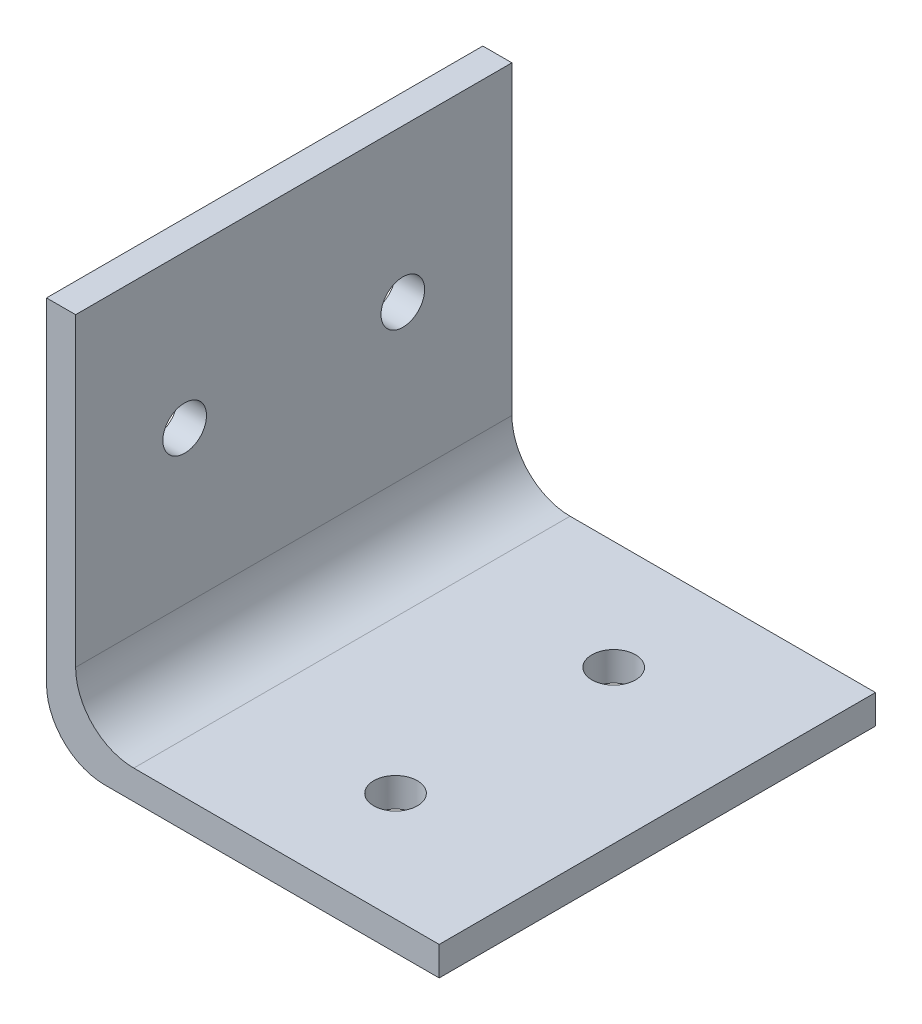
ISO-10303-21;
HEADER;
FILE_DESCRIPTION(('STEP AP214'),'2;1');
FILE_NAME('part.step','',(''),(''),'','','');
FILE_SCHEMA(('AUTOMOTIVE_DESIGN { 1 0 10303 214 1 1 1 1 }'));
ENDSEC;
DATA;
#1=APPLICATION_CONTEXT('core data for automotive mechanical design processes');
#2=APPLICATION_PROTOCOL_DEFINITION('international standard','automotive_design',2000,#1);
#3=PRODUCT_CONTEXT('',#1,'mechanical');
#4=PRODUCT('Part','Part','',(#3));
#5=PRODUCT_RELATED_PRODUCT_CATEGORY('part','',(#4));
#6=PRODUCT_DEFINITION_FORMATION('','',#4);
#7=PRODUCT_DEFINITION_CONTEXT('part definition',#1,'design');
#8=PRODUCT_DEFINITION('design','',#6,#7);
#9=PRODUCT_DEFINITION_SHAPE('','',#8);
#10=(LENGTH_UNIT() NAMED_UNIT(*) SI_UNIT(.MILLI.,.METRE.));
#11=(NAMED_UNIT(*) PLANE_ANGLE_UNIT() SI_UNIT($,.RADIAN.));
#12=(NAMED_UNIT(*) SI_UNIT($,.STERADIAN.) SOLID_ANGLE_UNIT());
#13=UNCERTAINTY_MEASURE_WITH_UNIT(LENGTH_MEASURE(1.E-05),#10,'distance_accuracy_value','');
#14=(GEOMETRIC_REPRESENTATION_CONTEXT(3) GLOBAL_UNCERTAINTY_ASSIGNED_CONTEXT((#13)) GLOBAL_UNIT_ASSIGNED_CONTEXT((#10,
#11,#12)) REPRESENTATION_CONTEXT('',''));
#15=CARTESIAN_POINT('',(0.,0.,0.));
#16=DIRECTION('',(0.,0.,1.));
#17=DIRECTION('',(1.,0.,0.));
#18=AXIS2_PLACEMENT_3D('',#15,#16,#17);
#19=CARTESIAN_POINT('',(0.,25.,-30.));
#20=DIRECTION('',(1.,0.,0.));
#21=DIRECTION('',(0.,1.,0.));
#22=AXIS2_PLACEMENT_3D('',#19,#20,#21);
#23=PLANE('',#22);
#24=CARTESIAN_POINT('',(0.,14.5,-7.5));
#25=DIRECTION('',(1.,0.,0.));
#26=DIRECTION('',(0.,0.,-1.));
#27=AXIS2_PLACEMENT_3D('',#24,#25,#26);
#28=CIRCLE('',#27,1.49999999999999);
#29=CARTESIAN_POINT('',(0.,14.5,-8.99999999999999));
#30=VERTEX_POINT('',#29);
#31=EDGE_CURVE('E232',#30,#30,#28,.T.);
#32=ORIENTED_EDGE('',*,*,#31,.F.);
#33=EDGE_LOOP('',(#32));
#34=FACE_BOUND('',#33,.T.);
#35=CARTESIAN_POINT('',(0.,14.5,-22.5));
#36=DIRECTION('',(1.,0.,0.));
#37=DIRECTION('',(0.,0.,-1.));
#38=AXIS2_PLACEMENT_3D('',#35,#36,#37);
#39=CIRCLE('',#38,1.49999999999999);
#40=CARTESIAN_POINT('',(0.,14.5,-24.));
#41=VERTEX_POINT('',#40);
#42=EDGE_CURVE('E236',#41,#41,#39,.T.);
#43=ORIENTED_EDGE('',*,*,#42,.F.);
#44=EDGE_LOOP('',(#43));
#45=FACE_BOUND('',#44,.T.);
#46=DIRECTION('',(0.,1.,0.));
#47=VECTOR('',#46,1.);
#48=CARTESIAN_POINT('',(0.,25.,0.));
#49=LINE('',#48,#47);
#50=CARTESIAN_POINT('',(0.,4.,0.));
#51=VERTEX_POINT('',#50);
#52=CARTESIAN_POINT('',(0.,25.,0.));
#53=VERTEX_POINT('',#52);
#54=EDGE_CURVE('E134',#51,#53,#49,.T.);
#55=ORIENTED_EDGE('',*,*,#54,.F.);
#56=DIRECTION('',(0.,0.,1.));
#57=VECTOR('',#56,1.);
#58=CARTESIAN_POINT('',(0.,4.,-30.));
#59=LINE('',#58,#57);
#60=CARTESIAN_POINT('',(0.,4.,-30.));
#61=VERTEX_POINT('',#60);
#62=EDGE_CURVE('E104',#51,#61,#59,.F.);
#63=ORIENTED_EDGE('',*,*,#62,.T.);
#64=DIRECTION('',(0.,1.,0.));
#65=VECTOR('',#64,1.);
#66=CARTESIAN_POINT('',(0.,25.,-30.));
#67=LINE('',#66,#65);
#68=CARTESIAN_POINT('',(0.,25.,-30.));
#69=VERTEX_POINT('',#68);
#70=EDGE_CURVE('E98',#61,#69,#67,.T.);
#71=ORIENTED_EDGE('',*,*,#70,.T.);
#72=DIRECTION('',(0.,0.,1.));
#73=VECTOR('',#72,1.);
#74=CARTESIAN_POINT('',(0.,25.,-30.));
#75=LINE('',#74,#73);
#76=EDGE_CURVE('E101',#69,#53,#75,.T.);
#77=ORIENTED_EDGE('',*,*,#76,.T.);
#78=EDGE_LOOP('',(#55,#63,#71,#77));
#79=FACE_BOUND('',#78,.T.);
#80=ADVANCED_FACE('F35',(#34,#45,#79),#23,.T.);
#81=CARTESIAN_POINT('',(0.,0.,-30.));
#82=DIRECTION('',(0.,1.,0.));
#83=DIRECTION('',(0.,0.,1.));
#84=AXIS2_PLACEMENT_3D('',#81,#82,#83);
#85=PLANE('',#84);
#86=CARTESIAN_POINT('',(14.5,0.,-22.5));
#87=DIRECTION('',(0.,1.,0.));
#88=DIRECTION('',(0.,0.,1.));
#89=AXIS2_PLACEMENT_3D('',#86,#87,#88);
#90=CIRCLE('',#89,1.49999999999999);
#91=CARTESIAN_POINT('',(14.5,0.,-21.));
#92=VERTEX_POINT('',#91);
#93=EDGE_CURVE('E245',#92,#92,#90,.T.);
#94=ORIENTED_EDGE('',*,*,#93,.F.);
#95=EDGE_LOOP('',(#94));
#96=FACE_BOUND('',#95,.T.);
#97=CARTESIAN_POINT('',(14.5,0.,-7.5));
#98=DIRECTION('',(0.,1.,0.));
#99=DIRECTION('',(0.,0.,1.));
#100=AXIS2_PLACEMENT_3D('',#97,#98,#99);
#101=CIRCLE('',#100,1.49999999999999);
#102=CARTESIAN_POINT('',(14.5,0.,-6.00000000000001));
#103=VERTEX_POINT('',#102);
#104=EDGE_CURVE('E251',#103,#103,#101,.T.);
#105=ORIENTED_EDGE('',*,*,#104,.F.);
#106=EDGE_LOOP('',(#105));
#107=FACE_BOUND('',#106,.T.);
#108=DIRECTION('',(-1.,0.,0.));
#109=VECTOR('',#108,1.);
#110=CARTESIAN_POINT('',(0.,0.,-30.));
#111=LINE('',#110,#109);
#112=CARTESIAN_POINT('',(25.,0.,-30.));
#113=VERTEX_POINT('',#112);
#114=CARTESIAN_POINT('',(4.,0.,-30.));
#115=VERTEX_POINT('',#114);
#116=EDGE_CURVE('E117',#113,#115,#111,.T.);
#117=ORIENTED_EDGE('',*,*,#116,.T.);
#118=DIRECTION('',(0.,0.,1.));
#119=VECTOR('',#118,1.);
#120=CARTESIAN_POINT('',(4.,0.,0.));
#121=LINE('',#120,#119);
#122=CARTESIAN_POINT('',(4.,0.,0.));
#123=VERTEX_POINT('',#122);
#124=EDGE_CURVE('E149',#115,#123,#121,.T.);
#125=ORIENTED_EDGE('',*,*,#124,.T.);
#126=DIRECTION('',(-1.,0.,0.));
#127=VECTOR('',#126,1.);
#128=CARTESIAN_POINT('',(0.,0.,0.));
#129=LINE('',#128,#127);
#130=CARTESIAN_POINT('',(25.,0.,0.));
#131=VERTEX_POINT('',#130);
#132=EDGE_CURVE('E109',#131,#123,#129,.T.);
#133=ORIENTED_EDGE('',*,*,#132,.F.);
#134=DIRECTION('',(0.,0.,1.));
#135=VECTOR('',#134,1.);
#136=CARTESIAN_POINT('',(25.,0.,-30.));
#137=LINE('',#136,#135);
#138=EDGE_CURVE('E147',#113,#131,#137,.T.);
#139=ORIENTED_EDGE('',*,*,#138,.F.);
#140=EDGE_LOOP('',(#117,#125,#133,#139));
#141=FACE_BOUND('',#140,.T.);
#142=ADVANCED_FACE('F177',(#96,#107,#141),#85,.T.);
#143=CARTESIAN_POINT('',(25.,0.,-30.));
#144=DIRECTION('',(1.,0.,0.));
#145=DIRECTION('',(0.,0.,-1.));
#146=AXIS2_PLACEMENT_3D('',#143,#144,#145);
#147=PLANE('',#146);
#148=DIRECTION('',(0.,1.,0.));
#149=VECTOR('',#148,1.);
#150=CARTESIAN_POINT('',(25.,0.,0.));
#151=LINE('',#150,#149);
#152=CARTESIAN_POINT('',(25.,-2.,0.));
#153=VERTEX_POINT('',#152);
#154=EDGE_CURVE('E142',#153,#131,#151,.T.);
#155=ORIENTED_EDGE('',*,*,#154,.F.);
#156=DIRECTION('',(0.,0.,1.));
#157=VECTOR('',#156,1.);
#158=CARTESIAN_POINT('',(25.,-2.,-30.));
#159=LINE('',#158,#157);
#160=CARTESIAN_POINT('',(25.,-2.,-30.));
#161=VERTEX_POINT('',#160);
#162=EDGE_CURVE('E150',#161,#153,#159,.T.);
#163=ORIENTED_EDGE('',*,*,#162,.F.);
#164=DIRECTION('',(0.,1.,0.));
#165=VECTOR('',#164,1.);
#166=CARTESIAN_POINT('',(25.,0.,-30.));
#167=LINE('',#166,#165);
#168=EDGE_CURVE('E129',#161,#113,#167,.T.);
#169=ORIENTED_EDGE('',*,*,#168,.T.);
#170=ORIENTED_EDGE('',*,*,#138,.T.);
#171=EDGE_LOOP('',(#155,#163,#169,#170));
#172=FACE_BOUND('',#171,.T.);
#173=ADVANCED_FACE('F182',(#172),#147,.T.);
#174=CARTESIAN_POINT('',(25.,-2.,-30.));
#175=DIRECTION('',(0.,-1.,0.));
#176=DIRECTION('',(1.,0.,0.));
#177=AXIS2_PLACEMENT_3D('',#174,#175,#176);
#178=PLANE('',#177);
#179=CARTESIAN_POINT('',(14.5,-2.,-22.5));
#180=DIRECTION('',(0.,-1.,0.));
#181=DIRECTION('',(1.,0.,0.));
#182=AXIS2_PLACEMENT_3D('',#179,#180,#181);
#183=CIRCLE('',#182,1.49999999999999);
#184=CARTESIAN_POINT('',(16.,-2.,-22.5));
#185=VERTEX_POINT('',#184);
#186=EDGE_CURVE('E248',#185,#185,#183,.T.);
#187=ORIENTED_EDGE('',*,*,#186,.F.);
#188=EDGE_LOOP('',(#187));
#189=FACE_BOUND('',#188,.T.);
#190=CARTESIAN_POINT('',(14.5,-2.,-7.5));
#191=DIRECTION('',(0.,-1.,0.));
#192=DIRECTION('',(1.,0.,0.));
#193=AXIS2_PLACEMENT_3D('',#190,#191,#192);
#194=CIRCLE('',#193,1.49999999999999);
#195=CARTESIAN_POINT('',(16.,-2.,-7.5));
#196=VERTEX_POINT('',#195);
#197=EDGE_CURVE('E136',#196,#196,#194,.T.);
#198=ORIENTED_EDGE('',*,*,#197,.F.);
#199=EDGE_LOOP('',(#198));
#200=FACE_BOUND('',#199,.T.);
#201=DIRECTION('',(1.,0.,0.));
#202=VECTOR('',#201,1.);
#203=CARTESIAN_POINT('',(25.,-2.,0.));
#204=LINE('',#203,#202);
#205=CARTESIAN_POINT('',(2.,-2.,0.));
#206=VERTEX_POINT('',#205);
#207=EDGE_CURVE('E140',#206,#153,#204,.T.);
#208=ORIENTED_EDGE('',*,*,#207,.F.);
#209=DIRECTION('',(0.,0.,1.));
#210=VECTOR('',#209,1.);
#211=CARTESIAN_POINT('',(2.,-2.,-30.));
#212=LINE('',#211,#210);
#213=CARTESIAN_POINT('',(2.,-2.,-30.));
#214=VERTEX_POINT('',#213);
#215=EDGE_CURVE('E43',#206,#214,#212,.F.);
#216=ORIENTED_EDGE('',*,*,#215,.T.);
#217=DIRECTION('',(1.,0.,0.));
#218=VECTOR('',#217,1.);
#219=CARTESIAN_POINT('',(25.,-2.,-30.));
#220=LINE('',#219,#218);
#221=EDGE_CURVE('E124',#214,#161,#220,.T.);
#222=ORIENTED_EDGE('',*,*,#221,.T.);
#223=ORIENTED_EDGE('',*,*,#162,.T.);
#224=EDGE_LOOP('',(#208,#216,#222,#223));
#225=FACE_BOUND('',#224,.T.);
#226=ADVANCED_FACE('F207',(#189,#200,#225),#178,.T.);
#227=CARTESIAN_POINT('',(-2.,-2.00000000000001,-30.));
#228=DIRECTION('',(-1.,0.,0.));
#229=DIRECTION('',(0.,-1.,0.));
#230=AXIS2_PLACEMENT_3D('',#227,#228,#229);
#231=PLANE('',#230);
#232=CARTESIAN_POINT('',(-2.,14.5,-7.5));
#233=DIRECTION('',(-1.,0.,0.));
#234=DIRECTION('',(0.,-1.,0.));
#235=AXIS2_PLACEMENT_3D('',#232,#233,#234);
#236=CIRCLE('',#235,1.49999999999999);
#237=CARTESIAN_POINT('',(-2.,13.,-7.5));
#238=VERTEX_POINT('',#237);
#239=EDGE_CURVE('E235',#238,#238,#236,.T.);
#240=ORIENTED_EDGE('',*,*,#239,.F.);
#241=EDGE_LOOP('',(#240));
#242=FACE_BOUND('',#241,.T.);
#243=CARTESIAN_POINT('',(-2.,14.5,-22.5));
#244=DIRECTION('',(-1.,0.,0.));
#245=DIRECTION('',(0.,-1.,0.));
#246=AXIS2_PLACEMENT_3D('',#243,#244,#245);
#247=CIRCLE('',#246,1.49999999999999);
#248=CARTESIAN_POINT('',(-2.,13.,-22.5));
#249=VERTEX_POINT('',#248);
#250=EDGE_CURVE('E239',#249,#249,#247,.T.);
#251=ORIENTED_EDGE('',*,*,#250,.F.);
#252=EDGE_LOOP('',(#251));
#253=FACE_BOUND('',#252,.T.);
#254=DIRECTION('',(0.,-1.,0.));
#255=VECTOR('',#254,1.);
#256=CARTESIAN_POINT('',(-2.,-2.00000000000001,-30.));
#257=LINE('',#256,#255);
#258=CARTESIAN_POINT('',(-2.,25.,-30.));
#259=VERTEX_POINT('',#258);
#260=CARTESIAN_POINT('',(-2.,2.,-30.));
#261=VERTEX_POINT('',#260);
#262=EDGE_CURVE('E122',#259,#261,#257,.T.);
#263=ORIENTED_EDGE('',*,*,#262,.T.);
#264=DIRECTION('',(0.,0.,1.));
#265=VECTOR('',#264,1.);
#266=CARTESIAN_POINT('',(-2.,2.,-30.));
#267=LINE('',#266,#265);
#268=CARTESIAN_POINT('',(-2.,2.,0.));
#269=VERTEX_POINT('',#268);
#270=EDGE_CURVE('E161',#261,#269,#267,.T.);
#271=ORIENTED_EDGE('',*,*,#270,.T.);
#272=DIRECTION('',(0.,-1.,0.));
#273=VECTOR('',#272,1.);
#274=CARTESIAN_POINT('',(-2.,-2.00000000000001,0.));
#275=LINE('',#274,#273);
#276=CARTESIAN_POINT('',(-2.,25.,0.));
#277=VERTEX_POINT('',#276);
#278=EDGE_CURVE('E138',#277,#269,#275,.T.);
#279=ORIENTED_EDGE('',*,*,#278,.F.);
#280=DIRECTION('',(0.,0.,1.));
#281=VECTOR('',#280,1.);
#282=CARTESIAN_POINT('',(-2.,25.,-30.));
#283=LINE('',#282,#281);
#284=EDGE_CURVE('E116',#259,#277,#283,.T.);
#285=ORIENTED_EDGE('',*,*,#284,.F.);
#286=EDGE_LOOP('',(#263,#271,#279,#285));
#287=FACE_BOUND('',#286,.T.);
#288=ADVANCED_FACE('F167',(#242,#253,#287),#231,.T.);
#289=CARTESIAN_POINT('',(-2.,25.,-30.));
#290=DIRECTION('',(0.,1.,0.));
#291=DIRECTION('',(0.,0.,1.));
#292=AXIS2_PLACEMENT_3D('',#289,#290,#291);
#293=PLANE('',#292);
#294=DIRECTION('',(-1.,0.,0.));
#295=VECTOR('',#294,1.);
#296=CARTESIAN_POINT('',(-2.,25.,0.));
#297=LINE('',#296,#295);
#298=EDGE_CURVE('E115',#53,#277,#297,.T.);
#299=ORIENTED_EDGE('',*,*,#298,.F.);
#300=ORIENTED_EDGE('',*,*,#76,.F.);
#301=DIRECTION('',(-1.,0.,0.));
#302=VECTOR('',#301,1.);
#303=CARTESIAN_POINT('',(-2.,25.,-30.));
#304=LINE('',#303,#302);
#305=EDGE_CURVE('E108',#69,#259,#304,.T.);
#306=ORIENTED_EDGE('',*,*,#305,.T.);
#307=ORIENTED_EDGE('',*,*,#284,.T.);
#308=EDGE_LOOP('',(#299,#300,#306,#307));
#309=FACE_BOUND('',#308,.T.);
#310=ADVANCED_FACE('F113',(#309),#293,.T.);
#311=CARTESIAN_POINT('',(0.,0.,-30.));
#312=DIRECTION('',(0.,0.,1.));
#313=DIRECTION('',(1.,0.,0.));
#314=AXIS2_PLACEMENT_3D('',#311,#312,#313);
#315=PLANE('',#314);
#316=ORIENTED_EDGE('',*,*,#221,.F.);
#317=CARTESIAN_POINT('',(2.,2.,-30.));
#318=DIRECTION('',(0.,0.,1.));
#319=DIRECTION('',(1.,0.,0.));
#320=AXIS2_PLACEMENT_3D('',#317,#318,#319);
#321=CIRCLE('',#320,4.);
#322=EDGE_CURVE('E11',#214,#261,#321,.F.);
#323=ORIENTED_EDGE('',*,*,#322,.T.);
#324=ORIENTED_EDGE('',*,*,#262,.F.);
#325=ORIENTED_EDGE('',*,*,#305,.F.);
#326=ORIENTED_EDGE('',*,*,#70,.F.);
#327=CARTESIAN_POINT('',(4.,4.,-30.));
#328=DIRECTION('',(0.,0.,1.));
#329=DIRECTION('',(1.,0.,0.));
#330=AXIS2_PLACEMENT_3D('',#327,#328,#329);
#331=CIRCLE('',#330,4.);
#332=EDGE_CURVE('E159',#61,#115,#331,.T.);
#333=ORIENTED_EDGE('',*,*,#332,.T.);
#334=ORIENTED_EDGE('',*,*,#116,.F.);
#335=ORIENTED_EDGE('',*,*,#168,.F.);
#336=EDGE_LOOP('',(#316,#323,#324,#325,#326,#333,#334,#335));
#337=FACE_BOUND('',#336,.T.);
#338=ADVANCED_FACE('F120',(#337),#315,.F.);
#339=CARTESIAN_POINT('',(0.,0.,0.));
#340=DIRECTION('',(0.,0.,1.));
#341=DIRECTION('',(1.,0.,0.));
#342=AXIS2_PLACEMENT_3D('',#339,#340,#341);
#343=PLANE('',#342);
#344=ORIENTED_EDGE('',*,*,#278,.T.);
#345=CARTESIAN_POINT('',(2.,2.,0.));
#346=DIRECTION('',(0.,0.,1.));
#347=DIRECTION('',(1.,0.,0.));
#348=AXIS2_PLACEMENT_3D('',#345,#346,#347);
#349=CIRCLE('',#348,4.);
#350=EDGE_CURVE('E57',#269,#206,#349,.T.);
#351=ORIENTED_EDGE('',*,*,#350,.T.);
#352=ORIENTED_EDGE('',*,*,#207,.T.);
#353=ORIENTED_EDGE('',*,*,#154,.T.);
#354=ORIENTED_EDGE('',*,*,#132,.T.);
#355=CARTESIAN_POINT('',(4.,4.,0.));
#356=DIRECTION('',(0.,0.,1.));
#357=DIRECTION('',(1.,0.,0.));
#358=AXIS2_PLACEMENT_3D('',#355,#356,#357);
#359=CIRCLE('',#358,4.);
#360=EDGE_CURVE('E157',#123,#51,#359,.F.);
#361=ORIENTED_EDGE('',*,*,#360,.T.);
#362=ORIENTED_EDGE('',*,*,#54,.T.);
#363=ORIENTED_EDGE('',*,*,#298,.T.);
#364=EDGE_LOOP('',(#344,#351,#352,#353,#354,#361,#362,#363));
#365=FACE_BOUND('',#364,.T.);
#366=ADVANCED_FACE('F170',(#365),#343,.T.);
#367=CARTESIAN_POINT('',(4.,4.,-30.));
#368=DIRECTION('',(0.,0.,-1.));
#369=DIRECTION('',(-1.,0.,0.));
#370=AXIS2_PLACEMENT_3D('',#367,#368,#369);
#371=CYLINDRICAL_SURFACE('',#370,4.);
#372=ORIENTED_EDGE('',*,*,#332,.F.);
#373=ORIENTED_EDGE('',*,*,#62,.F.);
#374=ORIENTED_EDGE('',*,*,#360,.F.);
#375=ORIENTED_EDGE('',*,*,#124,.F.);
#376=EDGE_LOOP('',(#372,#373,#374,#375));
#377=FACE_BOUND('',#376,.T.);
#378=ADVANCED_FACE('F172',(#377),#371,.F.);
#379=CARTESIAN_POINT('',(2.,2.,-30.));
#380=DIRECTION('',(0.,0.,1.));
#381=DIRECTION('',(1.,0.,0.));
#382=AXIS2_PLACEMENT_3D('',#379,#380,#381);
#383=CYLINDRICAL_SURFACE('',#382,4.);
#384=ORIENTED_EDGE('',*,*,#322,.F.);
#385=ORIENTED_EDGE('',*,*,#215,.F.);
#386=ORIENTED_EDGE('',*,*,#350,.F.);
#387=ORIENTED_EDGE('',*,*,#270,.F.);
#388=EDGE_LOOP('',(#384,#385,#386,#387));
#389=FACE_BOUND('',#388,.T.);
#390=ADVANCED_FACE('F37',(#389),#383,.T.);
#391=CARTESIAN_POINT('',(14.5,0.,-7.5));
#392=DIRECTION('',(0.,1.,0.));
#393=DIRECTION('',(0.,0.,1.));
#394=AXIS2_PLACEMENT_3D('',#391,#392,#393);
#395=CYLINDRICAL_SURFACE('',#394,1.49999999999999);
#396=ORIENTED_EDGE('',*,*,#104,.T.);
#397=EDGE_LOOP('',(#396));
#398=FACE_BOUND('',#397,.T.);
#399=ORIENTED_EDGE('',*,*,#197,.T.);
#400=EDGE_LOOP('',(#399));
#401=FACE_BOUND('',#400,.T.);
#402=ADVANCED_FACE('F184',(#398,#401),#395,.F.);
#403=CARTESIAN_POINT('',(14.5,0.,-22.5));
#404=DIRECTION('',(0.,1.,0.));
#405=DIRECTION('',(0.,0.,1.));
#406=AXIS2_PLACEMENT_3D('',#403,#404,#405);
#407=CYLINDRICAL_SURFACE('',#406,1.49999999999999);
#408=ORIENTED_EDGE('',*,*,#93,.T.);
#409=EDGE_LOOP('',(#408));
#410=FACE_BOUND('',#409,.T.);
#411=ORIENTED_EDGE('',*,*,#186,.T.);
#412=EDGE_LOOP('',(#411));
#413=FACE_BOUND('',#412,.T.);
#414=ADVANCED_FACE('F189',(#410,#413),#407,.F.);
#415=CARTESIAN_POINT('',(0.,14.5,-22.5));
#416=DIRECTION('',(1.,0.,0.));
#417=DIRECTION('',(0.,0.,-1.));
#418=AXIS2_PLACEMENT_3D('',#415,#416,#417);
#419=CYLINDRICAL_SURFACE('',#418,1.49999999999999);
#420=ORIENTED_EDGE('',*,*,#42,.T.);
#421=EDGE_LOOP('',(#420));
#422=FACE_BOUND('',#421,.T.);
#423=ORIENTED_EDGE('',*,*,#250,.T.);
#424=EDGE_LOOP('',(#423));
#425=FACE_BOUND('',#424,.T.);
#426=ADVANCED_FACE('F220',(#422,#425),#419,.F.);
#427=CARTESIAN_POINT('',(0.,14.5,-7.5));
#428=DIRECTION('',(1.,0.,0.));
#429=DIRECTION('',(0.,0.,-1.));
#430=AXIS2_PLACEMENT_3D('',#427,#428,#429);
#431=CYLINDRICAL_SURFACE('',#430,1.49999999999999);
#432=ORIENTED_EDGE('',*,*,#31,.T.);
#433=EDGE_LOOP('',(#432));
#434=FACE_BOUND('',#433,.T.);
#435=ORIENTED_EDGE('',*,*,#239,.T.);
#436=EDGE_LOOP('',(#435));
#437=FACE_BOUND('',#436,.T.);
#438=ADVANCED_FACE('F224',(#434,#437),#431,.F.);
#439=CLOSED_SHELL('',(#80,#142,#173,#226,#288,#310,#338,#366,#378,#390,#402,#414,#426,#438));
#440=MANIFOLD_SOLID_BREP('B2',#439);
#441=ADVANCED_BREP_SHAPE_REPRESENTATION('',(#18,#440),#14);
#442=SHAPE_DEFINITION_REPRESENTATION(#9,#441);
ENDSEC;
END-ISO-10303-21;
